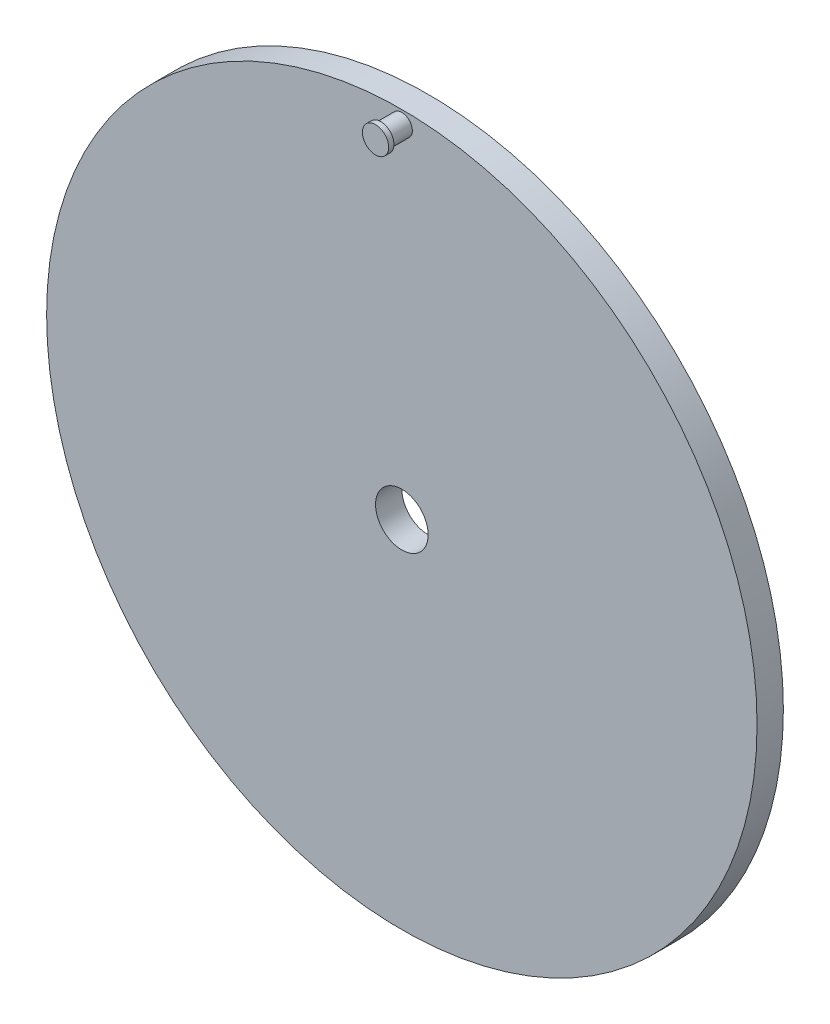
ISO-10303-21;
HEADER;
FILE_DESCRIPTION(('STEP AP214'),'2;1');
FILE_NAME('part.step','',(''),(''),'','','');
FILE_SCHEMA(('AUTOMOTIVE_DESIGN { 1 0 10303 214 1 1 1 1 }'));
ENDSEC;
DATA;
#1=APPLICATION_CONTEXT('core data for automotive mechanical design processes');
#2=APPLICATION_PROTOCOL_DEFINITION('international standard','automotive_design',2000,#1);
#3=PRODUCT_CONTEXT('',#1,'mechanical');
#4=PRODUCT('Part','Part','',(#3));
#5=PRODUCT_RELATED_PRODUCT_CATEGORY('part','',(#4));
#6=PRODUCT_DEFINITION_FORMATION('','',#4);
#7=PRODUCT_DEFINITION_CONTEXT('part definition',#1,'design');
#8=PRODUCT_DEFINITION('design','',#6,#7);
#9=PRODUCT_DEFINITION_SHAPE('','',#8);
#10=(LENGTH_UNIT() NAMED_UNIT(*) SI_UNIT(.MILLI.,.METRE.));
#11=(NAMED_UNIT(*) PLANE_ANGLE_UNIT() SI_UNIT($,.RADIAN.));
#12=(NAMED_UNIT(*) SI_UNIT($,.STERADIAN.) SOLID_ANGLE_UNIT());
#13=UNCERTAINTY_MEASURE_WITH_UNIT(LENGTH_MEASURE(1.E-05),#10,'distance_accuracy_value','');
#14=(GEOMETRIC_REPRESENTATION_CONTEXT(3) GLOBAL_UNCERTAINTY_ASSIGNED_CONTEXT((#13)) GLOBAL_UNIT_ASSIGNED_CONTEXT((#10,
#11,#12)) REPRESENTATION_CONTEXT('',''));
#15=CARTESIAN_POINT('',(0.,0.,0.));
#16=DIRECTION('',(0.,0.,1.));
#17=DIRECTION('',(1.,0.,0.));
#18=AXIS2_PLACEMENT_3D('',#15,#16,#17);
#19=CARTESIAN_POINT('',(0.,0.,2.5));
#20=DIRECTION('',(0.,0.,1.));
#21=DIRECTION('',(1.,0.,0.));
#22=AXIS2_PLACEMENT_3D('',#19,#20,#21);
#23=PLANE('',#22);
#24=CARTESIAN_POINT('',(0.,65.,2.5));
#25=DIRECTION('',(0.,0.,1.));
#26=DIRECTION('',(1.,0.,0.));
#27=AXIS2_PLACEMENT_3D('',#24,#25,#26);
#28=CIRCLE('',#27,2.);
#29=CARTESIAN_POINT('',(2.,65.,2.5));
#30=VERTEX_POINT('',#29);
#31=EDGE_CURVE('E9',#30,#30,#28,.T.);
#32=ORIENTED_EDGE('',*,*,#31,.F.);
#33=EDGE_LOOP('',(#32));
#34=FACE_BOUND('',#33,.T.);
#35=CARTESIAN_POINT('',(0.,0.,2.5));
#36=DIRECTION('',(0.,0.,1.));
#37=DIRECTION('',(1.,0.,0.));
#38=AXIS2_PLACEMENT_3D('',#35,#36,#37);
#39=CIRCLE('',#38,67.5);
#40=CARTESIAN_POINT('',(67.5,0.,2.5));
#41=VERTEX_POINT('',#40);
#42=EDGE_CURVE('E20',#41,#41,#39,.T.);
#43=ORIENTED_EDGE('',*,*,#42,.T.);
#44=EDGE_LOOP('',(#43));
#45=FACE_BOUND('',#44,.T.);
#46=CARTESIAN_POINT('',(0.,0.,2.5));
#47=DIRECTION('',(0.,0.,1.));
#48=DIRECTION('',(1.,0.,0.));
#49=AXIS2_PLACEMENT_3D('',#46,#47,#48);
#50=CIRCLE('',#49,5.);
#51=CARTESIAN_POINT('',(5.,0.,2.5));
#52=VERTEX_POINT('',#51);
#53=EDGE_CURVE('E29',#52,#52,#50,.T.);
#54=ORIENTED_EDGE('',*,*,#53,.F.);
#55=EDGE_LOOP('',(#54));
#56=FACE_BOUND('',#55,.T.);
#57=ADVANCED_FACE('F13',(#34,#45,#56),#23,.T.);
#58=CARTESIAN_POINT('',(0.,0.,-2.5));
#59=DIRECTION('',(0.,0.,1.));
#60=DIRECTION('',(1.,0.,0.));
#61=AXIS2_PLACEMENT_3D('',#58,#59,#60);
#62=PLANE('',#61);
#63=CARTESIAN_POINT('',(0.,0.,-2.5));
#64=DIRECTION('',(0.,0.,1.));
#65=DIRECTION('',(1.,0.,0.));
#66=AXIS2_PLACEMENT_3D('',#63,#64,#65);
#67=CIRCLE('',#66,67.5);
#68=CARTESIAN_POINT('',(67.5,0.,-2.5));
#69=VERTEX_POINT('',#68);
#70=EDGE_CURVE('E24',#69,#69,#67,.T.);
#71=ORIENTED_EDGE('',*,*,#70,.F.);
#72=EDGE_LOOP('',(#71));
#73=FACE_BOUND('',#72,.T.);
#74=CARTESIAN_POINT('',(0.,0.,-2.5));
#75=DIRECTION('',(0.,0.,1.));
#76=DIRECTION('',(1.,0.,0.));
#77=AXIS2_PLACEMENT_3D('',#74,#75,#76);
#78=CIRCLE('',#77,5.);
#79=CARTESIAN_POINT('',(5.,0.,-2.5));
#80=VERTEX_POINT('',#79);
#81=EDGE_CURVE('E31',#80,#80,#78,.T.);
#82=ORIENTED_EDGE('',*,*,#81,.T.);
#83=EDGE_LOOP('',(#82));
#84=FACE_BOUND('',#83,.T.);
#85=ADVANCED_FACE('F66',(#73,#84),#62,.F.);
#86=CARTESIAN_POINT('',(0.,0.,2.5));
#87=DIRECTION('',(0.,0.,-1.));
#88=DIRECTION('',(-1.,0.,0.));
#89=AXIS2_PLACEMENT_3D('',#86,#87,#88);
#90=CYLINDRICAL_SURFACE('',#89,67.5);
#91=ORIENTED_EDGE('',*,*,#42,.F.);
#92=EDGE_LOOP('',(#91));
#93=FACE_BOUND('',#92,.T.);
#94=ORIENTED_EDGE('',*,*,#70,.T.);
#95=EDGE_LOOP('',(#94));
#96=FACE_BOUND('',#95,.T.);
#97=ADVANCED_FACE('F15',(#93,#96),#90,.T.);
#98=CARTESIAN_POINT('',(0.,0.,2.5));
#99=DIRECTION('',(0.,0.,-1.));
#100=DIRECTION('',(-1.,0.,0.));
#101=AXIS2_PLACEMENT_3D('',#98,#99,#100);
#102=CYLINDRICAL_SURFACE('',#101,5.);
#103=ORIENTED_EDGE('',*,*,#53,.T.);
#104=EDGE_LOOP('',(#103));
#105=FACE_BOUND('',#104,.T.);
#106=ORIENTED_EDGE('',*,*,#81,.F.);
#107=EDGE_LOOP('',(#106));
#108=FACE_BOUND('',#107,.T.);
#109=ADVANCED_FACE('F74',(#105,#108),#102,.F.);
#110=CARTESIAN_POINT('',(0.,65.,6.5));
#111=DIRECTION('',(0.,0.,-1.));
#112=DIRECTION('',(-1.,0.,0.));
#113=AXIS2_PLACEMENT_3D('',#110,#111,#112);
#114=CYLINDRICAL_SURFACE('',#113,2.);
#115=CARTESIAN_POINT('',(0.,65.,6.5));
#116=DIRECTION('',(0.,0.,1.));
#117=DIRECTION('',(1.,0.,0.));
#118=AXIS2_PLACEMENT_3D('',#115,#116,#117);
#119=CIRCLE('',#118,2.);
#120=CARTESIAN_POINT('',(2.,65.,6.5));
#121=VERTEX_POINT('',#120);
#122=EDGE_CURVE('E34',#121,#121,#119,.F.);
#123=ORIENTED_EDGE('',*,*,#122,.T.);
#124=EDGE_LOOP('',(#123));
#125=FACE_BOUND('',#124,.T.);
#126=ORIENTED_EDGE('',*,*,#31,.T.);
#127=EDGE_LOOP('',(#126));
#128=FACE_BOUND('',#127,.T.);
#129=ADVANCED_FACE('F51',(#125,#128),#114,.T.);
#130=CARTESIAN_POINT('',(0.,65.,7.5));
#131=DIRECTION('',(0.,0.,-1.));
#132=DIRECTION('',(-1.,0.,0.));
#133=AXIS2_PLACEMENT_3D('',#130,#131,#132);
#134=CYLINDRICAL_SURFACE('',#133,2.5);
#135=CARTESIAN_POINT('',(0.,65.,7.5));
#136=DIRECTION('',(0.,0.,1.));
#137=DIRECTION('',(1.,0.,0.));
#138=AXIS2_PLACEMENT_3D('',#135,#136,#137);
#139=CIRCLE('',#138,2.5);
#140=CARTESIAN_POINT('',(2.5,65.,7.5));
#141=VERTEX_POINT('',#140);
#142=EDGE_CURVE('E39',#141,#141,#139,.T.);
#143=ORIENTED_EDGE('',*,*,#142,.F.);
#144=EDGE_LOOP('',(#143));
#145=FACE_BOUND('',#144,.T.);
#146=CARTESIAN_POINT('',(0.,65.,6.5));
#147=DIRECTION('',(0.,0.,1.));
#148=DIRECTION('',(1.,0.,0.));
#149=AXIS2_PLACEMENT_3D('',#146,#147,#148);
#150=CIRCLE('',#149,2.5);
#151=CARTESIAN_POINT('',(2.5,65.,6.5));
#152=VERTEX_POINT('',#151);
#153=EDGE_CURVE('E40',#152,#152,#150,.T.);
#154=ORIENTED_EDGE('',*,*,#153,.T.);
#155=EDGE_LOOP('',(#154));
#156=FACE_BOUND('',#155,.T.);
#157=ADVANCED_FACE('F48',(#145,#156),#134,.T.);
#158=CARTESIAN_POINT('',(0.,65.,7.5));
#159=DIRECTION('',(0.,0.,1.));
#160=DIRECTION('',(1.,0.,0.));
#161=AXIS2_PLACEMENT_3D('',#158,#159,#160);
#162=PLANE('',#161);
#163=ORIENTED_EDGE('',*,*,#142,.T.);
#164=EDGE_LOOP('',(#163));
#165=FACE_BOUND('',#164,.T.);
#166=ADVANCED_FACE('F46',(#165),#162,.T.);
#167=CARTESIAN_POINT('',(0.,65.,6.5));
#168=DIRECTION('',(0.,0.,1.));
#169=DIRECTION('',(1.,0.,0.));
#170=AXIS2_PLACEMENT_3D('',#167,#168,#169);
#171=PLANE('',#170);
#172=ORIENTED_EDGE('',*,*,#122,.F.);
#173=EDGE_LOOP('',(#172));
#174=FACE_BOUND('',#173,.T.);
#175=ORIENTED_EDGE('',*,*,#153,.F.);
#176=EDGE_LOOP('',(#175));
#177=FACE_BOUND('',#176,.T.);
#178=ADVANCED_FACE('F55',(#174,#177),#171,.F.);
#179=CLOSED_SHELL('',(#57,#85,#97,#109,#129,#157,#166,#178));
#180=MANIFOLD_SOLID_BREP('B1',#179);
#181=ADVANCED_BREP_SHAPE_REPRESENTATION('',(#18,#180),#14);
#182=SHAPE_DEFINITION_REPRESENTATION(#9,#181);
ENDSEC;
END-ISO-10303-21;
